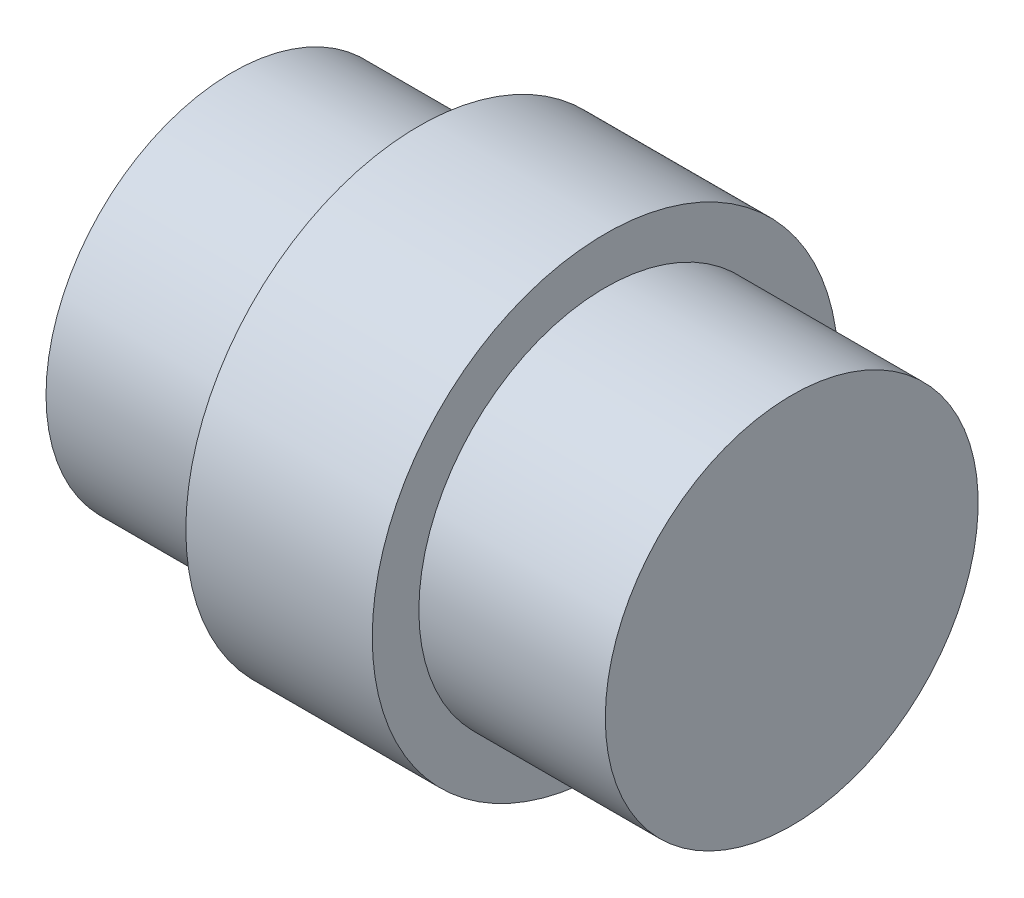
ISO-10303-21;
HEADER;
FILE_DESCRIPTION(('STEP AP214'),'2;1');
FILE_NAME('part.step','',(''),(''),'','','');
FILE_SCHEMA(('AUTOMOTIVE_DESIGN { 1 0 10303 214 1 1 1 1 }'));
ENDSEC;
DATA;
#1=APPLICATION_CONTEXT('core data for automotive mechanical design processes');
#2=APPLICATION_PROTOCOL_DEFINITION('international standard','automotive_design',2000,#1);
#3=PRODUCT_CONTEXT('',#1,'mechanical');
#4=PRODUCT('Part','Part','',(#3));
#5=PRODUCT_RELATED_PRODUCT_CATEGORY('part','',(#4));
#6=PRODUCT_DEFINITION_FORMATION('','',#4);
#7=PRODUCT_DEFINITION_CONTEXT('part definition',#1,'design');
#8=PRODUCT_DEFINITION('design','',#6,#7);
#9=PRODUCT_DEFINITION_SHAPE('','',#8);
#10=(LENGTH_UNIT() NAMED_UNIT(*) SI_UNIT(.MILLI.,.METRE.));
#11=(NAMED_UNIT(*) PLANE_ANGLE_UNIT() SI_UNIT($,.RADIAN.));
#12=(NAMED_UNIT(*) SI_UNIT($,.STERADIAN.) SOLID_ANGLE_UNIT());
#13=UNCERTAINTY_MEASURE_WITH_UNIT(LENGTH_MEASURE(1.E-05),#10,'distance_accuracy_value','');
#14=(GEOMETRIC_REPRESENTATION_CONTEXT(3) GLOBAL_UNCERTAINTY_ASSIGNED_CONTEXT((#13)) GLOBAL_UNIT_ASSIGNED_CONTEXT((#10,
#11,#12)) REPRESENTATION_CONTEXT('',''));
#15=CARTESIAN_POINT('',(0.,0.,0.));
#16=DIRECTION('',(0.,0.,1.));
#17=DIRECTION('',(1.,0.,0.));
#18=AXIS2_PLACEMENT_3D('',#15,#16,#17);
#19=CARTESIAN_POINT('',(15.,0.,0.));
#20=DIRECTION('',(-1.,0.,0.));
#21=DIRECTION('',(0.,0.,1.));
#22=AXIS2_PLACEMENT_3D('',#19,#20,#21);
#23=CYLINDRICAL_SURFACE('',#22,12.5);
#24=CARTESIAN_POINT('',(-5.,0.,0.));
#25=DIRECTION('',(-1.,0.,0.));
#26=DIRECTION('',(0.,0.,1.));
#27=AXIS2_PLACEMENT_3D('',#24,#25,#26);
#28=CIRCLE('',#27,12.5);
#29=CARTESIAN_POINT('',(-5.,0.,12.5));
#30=VERTEX_POINT('',#29);
#31=EDGE_CURVE('E10',#30,#30,#28,.T.);
#32=ORIENTED_EDGE('',*,*,#31,.F.);
#33=EDGE_LOOP('',(#32));
#34=FACE_BOUND('',#33,.T.);
#35=CARTESIAN_POINT('',(5.,0.,0.));
#36=DIRECTION('',(-1.,0.,0.));
#37=DIRECTION('',(0.,0.,1.));
#38=AXIS2_PLACEMENT_3D('',#35,#36,#37);
#39=CIRCLE('',#38,12.5);
#40=CARTESIAN_POINT('',(5.,0.,12.5));
#41=VERTEX_POINT('',#40);
#42=EDGE_CURVE('E55',#41,#41,#39,.T.);
#43=ORIENTED_EDGE('',*,*,#42,.T.);
#44=EDGE_LOOP('',(#43));
#45=FACE_BOUND('',#44,.T.);
#46=ADVANCED_FACE('F35',(#34,#45),#23,.T.);
#47=CARTESIAN_POINT('',(-5.,0.,0.));
#48=DIRECTION('',(-1.,0.,0.));
#49=DIRECTION('',(0.,0.,1.));
#50=AXIS2_PLACEMENT_3D('',#47,#48,#49);
#51=PLANE('',#50);
#52=CARTESIAN_POINT('',(-5.,0.,0.));
#53=DIRECTION('',(-1.,0.,0.));
#54=DIRECTION('',(0.,0.,1.));
#55=AXIS2_PLACEMENT_3D('',#52,#53,#54);
#56=CIRCLE('',#55,10.);
#57=CARTESIAN_POINT('',(-5.,0.,10.));
#58=VERTEX_POINT('',#57);
#59=EDGE_CURVE('E42',#58,#58,#56,.T.);
#60=ORIENTED_EDGE('',*,*,#59,.F.);
#61=EDGE_LOOP('',(#60));
#62=FACE_BOUND('',#61,.T.);
#63=ORIENTED_EDGE('',*,*,#31,.T.);
#64=EDGE_LOOP('',(#63));
#65=FACE_BOUND('',#64,.T.);
#66=ADVANCED_FACE('F82',(#62,#65),#51,.T.);
#67=CARTESIAN_POINT('',(-5.,0.,0.));
#68=DIRECTION('',(-1.,0.,0.));
#69=DIRECTION('',(0.,0.,1.));
#70=AXIS2_PLACEMENT_3D('',#67,#68,#69);
#71=CYLINDRICAL_SURFACE('',#70,10.);
#72=ORIENTED_EDGE('',*,*,#59,.T.);
#73=EDGE_LOOP('',(#72));
#74=FACE_BOUND('',#73,.T.);
#75=CARTESIAN_POINT('',(-15.,0.,0.));
#76=DIRECTION('',(-1.,0.,0.));
#77=DIRECTION('',(0.,0.,1.));
#78=AXIS2_PLACEMENT_3D('',#75,#76,#77);
#79=CIRCLE('',#78,10.);
#80=CARTESIAN_POINT('',(-15.,0.,10.));
#81=VERTEX_POINT('',#80);
#82=EDGE_CURVE('E49',#81,#81,#79,.T.);
#83=ORIENTED_EDGE('',*,*,#82,.F.);
#84=EDGE_LOOP('',(#83));
#85=FACE_BOUND('',#84,.T.);
#86=ADVANCED_FACE('F87',(#74,#85),#71,.T.);
#87=CARTESIAN_POINT('',(-15.,0.,0.));
#88=DIRECTION('',(1.,0.,0.));
#89=DIRECTION('',(0.,0.,-1.));
#90=AXIS2_PLACEMENT_3D('',#87,#88,#89);
#91=PLANE('',#90);
#92=ORIENTED_EDGE('',*,*,#82,.T.);
#93=EDGE_LOOP('',(#92));
#94=FACE_BOUND('',#93,.T.);
#95=ADVANCED_FACE('F93',(#94),#91,.F.);
#96=CARTESIAN_POINT('',(5.,0.,0.));
#97=DIRECTION('',(1.,0.,0.));
#98=DIRECTION('',(0.,0.,1.));
#99=AXIS2_PLACEMENT_3D('',#96,#97,#98);
#100=PLANE('',#99);
#101=ORIENTED_EDGE('',*,*,#42,.F.);
#102=EDGE_LOOP('',(#101));
#103=FACE_BOUND('',#102,.T.);
#104=CARTESIAN_POINT('',(5.,0.,0.));
#105=DIRECTION('',(-1.,0.,0.));
#106=DIRECTION('',(0.,0.,1.));
#107=AXIS2_PLACEMENT_3D('',#104,#105,#106);
#108=CIRCLE('',#107,10.);
#109=CARTESIAN_POINT('',(5.,0.,10.));
#110=VERTEX_POINT('',#109);
#111=EDGE_CURVE('E59',#110,#110,#108,.T.);
#112=ORIENTED_EDGE('',*,*,#111,.T.);
#113=EDGE_LOOP('',(#112));
#114=FACE_BOUND('',#113,.T.);
#115=ADVANCED_FACE('F67',(#103,#114),#100,.T.);
#116=CARTESIAN_POINT('',(5.,0.,0.));
#117=DIRECTION('',(1.,0.,0.));
#118=DIRECTION('',(0.,0.,-1.));
#119=AXIS2_PLACEMENT_3D('',#116,#117,#118);
#120=CYLINDRICAL_SURFACE('',#119,10.);
#121=ORIENTED_EDGE('',*,*,#111,.F.);
#122=EDGE_LOOP('',(#121));
#123=FACE_BOUND('',#122,.T.);
#124=CARTESIAN_POINT('',(15.,0.,0.));
#125=DIRECTION('',(-1.,0.,0.));
#126=DIRECTION('',(0.,0.,1.));
#127=AXIS2_PLACEMENT_3D('',#124,#125,#126);
#128=CIRCLE('',#127,10.);
#129=CARTESIAN_POINT('',(15.,0.,10.));
#130=VERTEX_POINT('',#129);
#131=EDGE_CURVE('E60',#130,#130,#128,.T.);
#132=ORIENTED_EDGE('',*,*,#131,.T.);
#133=EDGE_LOOP('',(#132));
#134=FACE_BOUND('',#133,.T.);
#135=ADVANCED_FACE('F69',(#123,#134),#120,.T.);
#136=CARTESIAN_POINT('',(15.,0.,0.));
#137=DIRECTION('',(1.,0.,0.));
#138=DIRECTION('',(0.,0.,-1.));
#139=AXIS2_PLACEMENT_3D('',#136,#137,#138);
#140=PLANE('',#139);
#141=ORIENTED_EDGE('',*,*,#131,.F.);
#142=EDGE_LOOP('',(#141));
#143=FACE_BOUND('',#142,.T.);
#144=ADVANCED_FACE('F72',(#143),#140,.T.);
#145=CLOSED_SHELL('',(#46,#66,#86,#95,#115,#135,#144));
#146=MANIFOLD_SOLID_BREP('B2',#145);
#147=ADVANCED_BREP_SHAPE_REPRESENTATION('',(#18,#146),#14);
#148=SHAPE_DEFINITION_REPRESENTATION(#9,#147);
ENDSEC;
END-ISO-10303-21;
